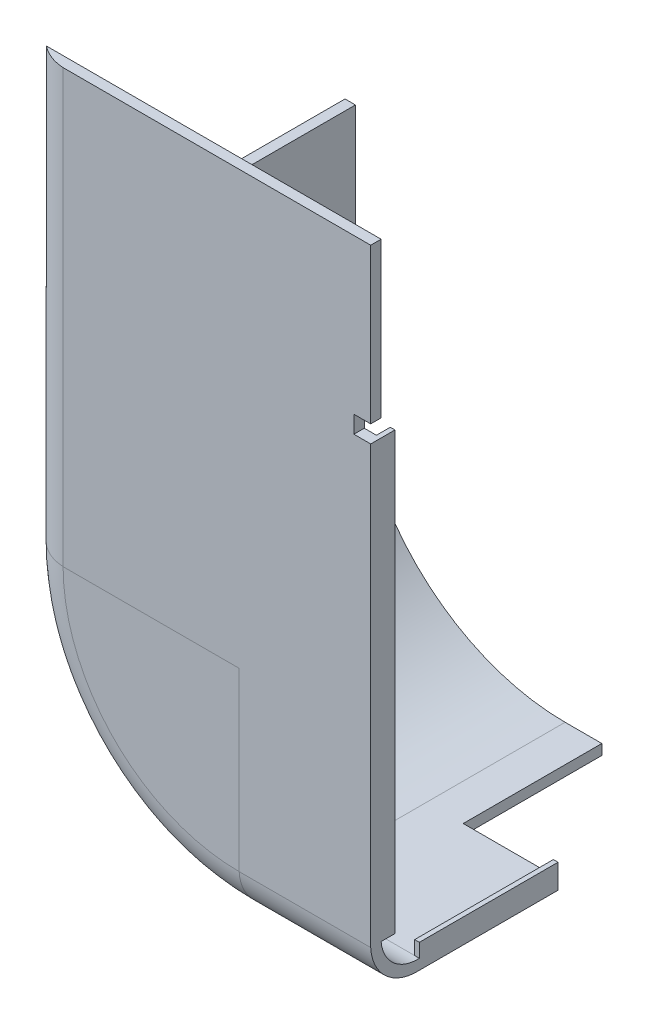
ISO-10303-21;
HEADER;
FILE_DESCRIPTION(('STEP AP214'),'2;1');
FILE_NAME('part.step','',(''),(''),'','','');
FILE_SCHEMA(('AUTOMOTIVE_DESIGN { 1 0 10303 214 1 1 1 1 }'));
ENDSEC;
DATA;
#1=APPLICATION_CONTEXT('core data for automotive mechanical design processes');
#2=APPLICATION_PROTOCOL_DEFINITION('international standard','automotive_design',2000,#1);
#3=PRODUCT_CONTEXT('',#1,'mechanical');
#4=PRODUCT('Part','Part','',(#3));
#5=PRODUCT_RELATED_PRODUCT_CATEGORY('part','',(#4));
#6=PRODUCT_DEFINITION_FORMATION('','',#4);
#7=PRODUCT_DEFINITION_CONTEXT('part definition',#1,'design');
#8=PRODUCT_DEFINITION('design','',#6,#7);
#9=PRODUCT_DEFINITION_SHAPE('','',#8);
#10=(LENGTH_UNIT() NAMED_UNIT(*) SI_UNIT(.MILLI.,.METRE.));
#11=(NAMED_UNIT(*) PLANE_ANGLE_UNIT() SI_UNIT($,.RADIAN.));
#12=(NAMED_UNIT(*) SI_UNIT($,.STERADIAN.) SOLID_ANGLE_UNIT());
#13=UNCERTAINTY_MEASURE_WITH_UNIT(LENGTH_MEASURE(1.E-05),#10,'distance_accuracy_value','');
#14=(GEOMETRIC_REPRESENTATION_CONTEXT(3) GLOBAL_UNCERTAINTY_ASSIGNED_CONTEXT((#13)) GLOBAL_UNIT_ASSIGNED_CONTEXT((#10,
#11,#12)) REPRESENTATION_CONTEXT('',''));
#15=CARTESIAN_POINT('',(0.,0.,0.));
#16=DIRECTION('',(0.,0.,1.));
#17=DIRECTION('',(1.,0.,0.));
#18=AXIS2_PLACEMENT_3D('',#15,#16,#17);
#19=CARTESIAN_POINT('',(-38.1,101.6,91.0390992622291));
#20=DIRECTION('',(0.,0.,1.));
#21=DIRECTION('',(1.,0.,0.));
#22=AXIS2_PLACEMENT_3D('',#19,#20,#21);
#23=PLANE('',#22);
#24=DIRECTION('',(0.,1.,0.));
#25=VECTOR('',#24,1.);
#26=CARTESIAN_POINT('',(-0.150000000000018,101.6,91.0390992622291));
#27=LINE('',#26,#25);
#28=CARTESIAN_POINT('',(-0.15000000000003,41.9405176116687,91.0390992622291));
#29=VERTEX_POINT('',#28);
#30=CARTESIAN_POINT('',(-0.150000000000025,86.6,91.0390992622291));
#31=VERTEX_POINT('',#30);
#32=EDGE_CURVE('E80',#29,#31,#27,.T.);
#33=ORIENTED_EDGE('',*,*,#32,.F.);
#34=DIRECTION('',(-1.,0.,0.));
#35=VECTOR('',#34,1.);
#36=CARTESIAN_POINT('',(-38.1,41.9405176116687,91.0390992622291));
#37=LINE('',#36,#35);
#38=CARTESIAN_POINT('',(-5.,41.9405176116687,91.0390992622291));
#39=VERTEX_POINT('',#38);
#40=EDGE_CURVE('E387',#29,#39,#37,.T.);
#41=ORIENTED_EDGE('',*,*,#40,.T.);
#42=DIRECTION('',(0.,-1.,0.));
#43=VECTOR('',#42,1.);
#44=CARTESIAN_POINT('',(-5.,101.6,91.0390992622291));
#45=LINE('',#44,#43);
#46=CARTESIAN_POINT('',(-5.,36.9405176116687,91.0390992622291));
#47=VERTEX_POINT('',#46);
#48=EDGE_CURVE('E384',#39,#47,#45,.T.);
#49=ORIENTED_EDGE('',*,*,#48,.T.);
#50=DIRECTION('',(1.,0.,0.));
#51=VECTOR('',#50,1.);
#52=CARTESIAN_POINT('',(-38.1,36.9405176116687,91.0390992622291));
#53=LINE('',#52,#51);
#54=CARTESIAN_POINT('',(-1.49999999999997,36.9405176116687,91.0390992622291));
#55=VERTEX_POINT('',#54);
#56=EDGE_CURVE('E381',#47,#55,#53,.T.);
#57=ORIENTED_EDGE('',*,*,#56,.T.);
#58=DIRECTION('',(0.,1.,0.));
#59=VECTOR('',#58,1.);
#60=CARTESIAN_POINT('',(-1.49999999999997,-88.9,91.0390992622291));
#61=LINE('',#60,#59);
#62=CARTESIAN_POINT('',(-1.49999999999997,-88.9000000000001,91.0390992622291));
#63=VERTEX_POINT('',#62);
#64=EDGE_CURVE('E268',#63,#55,#61,.T.);
#65=ORIENTED_EDGE('',*,*,#64,.F.);
#66=DIRECTION('',(1.,0.,0.));
#67=VECTOR('',#66,1.);
#68=CARTESIAN_POINT('',(-38.0999999999999,-88.9,91.0390992622291));
#69=LINE('',#68,#67);
#70=CARTESIAN_POINT('',(-38.0999999999999,-88.8999999999998,91.0390992622291));
#71=VERTEX_POINT('',#70);
#72=EDGE_CURVE('E283',#71,#63,#69,.T.);
#73=ORIENTED_EDGE('',*,*,#72,.F.);
#74=DIRECTION('',(0.,-1.,0.));
#75=VECTOR('',#74,1.);
#76=CARTESIAN_POINT('',(-38.0999999999998,-38.1,91.0390992622291));
#77=LINE('',#76,#75);
#78=CARTESIAN_POINT('',(-38.1,-38.1,91.0390992622291));
#79=VERTEX_POINT('',#78);
#80=EDGE_CURVE('E439',#79,#71,#77,.T.);
#81=ORIENTED_EDGE('',*,*,#80,.F.);
#82=DIRECTION('',(-1.,0.,0.));
#83=VECTOR('',#82,1.);
#84=CARTESIAN_POINT('',(-38.1,-38.1,91.0390992622291));
#85=LINE('',#84,#83);
#86=CARTESIAN_POINT('',(-88.9,-38.1,91.0390992622291));
#87=VERTEX_POINT('',#86);
#88=EDGE_CURVE('E383',#79,#87,#85,.T.);
#89=ORIENTED_EDGE('',*,*,#88,.T.);
#90=DIRECTION('',(0.,-1.,0.));
#91=VECTOR('',#90,1.);
#92=CARTESIAN_POINT('',(-88.9,101.6,91.0390992622291));
#93=LINE('',#92,#91);
#94=CARTESIAN_POINT('',(-88.9,25.4,91.0390992622291));
#95=VERTEX_POINT('',#94);
#96=EDGE_CURVE('E434',#95,#87,#93,.T.);
#97=ORIENTED_EDGE('',*,*,#96,.F.);
#98=DIRECTION('',(1.,0.,0.));
#99=VECTOR('',#98,1.);
#100=CARTESIAN_POINT('',(122.458490874742,25.4,91.0390992622291));
#101=LINE('',#100,#99);
#102=CARTESIAN_POINT('',(-96.6960037763842,25.4,91.0390992622291));
#103=VERTEX_POINT('',#102);
#104=EDGE_CURVE('E427',#103,#95,#101,.T.);
#105=ORIENTED_EDGE('',*,*,#104,.F.);
#106=DIRECTION('',(0.,-1.,0.));
#107=VECTOR('',#106,1.);
#108=CARTESIAN_POINT('',(-96.6960037763842,101.6,91.0390992622291));
#109=LINE('',#108,#107);
#110=CARTESIAN_POINT('',(-96.6960037763842,86.6,91.0390992622291));
#111=VERTEX_POINT('',#110);
#112=EDGE_CURVE('E421',#111,#103,#109,.T.);
#113=ORIENTED_EDGE('',*,*,#112,.F.);
#114=DIRECTION('',(-1.,0.,0.));
#115=VECTOR('',#114,1.);
#116=CARTESIAN_POINT('',(-38.1,86.6,91.0390992622291));
#117=LINE('',#116,#115);
#118=EDGE_CURVE('E292',#31,#111,#117,.T.);
#119=ORIENTED_EDGE('',*,*,#118,.F.);
#120=EDGE_LOOP('',(#33,#41,#49,#57,#65,#73,#81,#89,#97,#105,#113,#119));
#121=FACE_BOUND('',#120,.T.);
#122=ADVANCED_FACE('F70',(#121),#23,.F.);
#123=CARTESIAN_POINT('',(-38.1,101.6,94.0390992622291));
#124=DIRECTION('',(0.,0.,-1.));
#125=DIRECTION('',(-1.,0.,0.));
#126=AXIS2_PLACEMENT_3D('',#123,#124,#125);
#127=PLANE('',#126);
#128=DIRECTION('',(0.,-1.,0.));
#129=VECTOR('',#128,1.);
#130=CARTESIAN_POINT('',(-0.150000000000018,101.6,94.0390992622291));
#131=LINE('',#130,#129);
#132=CARTESIAN_POINT('',(-0.150000000000022,86.6,94.0390992622291));
#133=VERTEX_POINT('',#132);
#134=CARTESIAN_POINT('',(-0.15000000000003,41.9405176116687,94.0390992622291));
#135=VERTEX_POINT('',#134);
#136=EDGE_CURVE('E12',#133,#135,#131,.T.);
#137=ORIENTED_EDGE('',*,*,#136,.F.);
#138=DIRECTION('',(1.,0.,0.));
#139=VECTOR('',#138,1.);
#140=CARTESIAN_POINT('',(-38.1,86.6,94.0390992622291));
#141=LINE('',#140,#139);
#142=CARTESIAN_POINT('',(-88.9,86.6,94.0390992622291));
#143=VERTEX_POINT('',#142);
#144=EDGE_CURVE('E293',#143,#133,#141,.T.);
#145=ORIENTED_EDGE('',*,*,#144,.F.);
#146=DIRECTION('',(0.,-1.,0.));
#147=VECTOR('',#146,1.);
#148=CARTESIAN_POINT('',(-88.9,101.6,94.0390992622291));
#149=LINE('',#148,#147);
#150=CARTESIAN_POINT('',(-88.9,-38.1,94.0390992622291));
#151=VERTEX_POINT('',#150);
#152=EDGE_CURVE('E446',#143,#151,#149,.T.);
#153=ORIENTED_EDGE('',*,*,#152,.T.);
#154=DIRECTION('',(1.,0.,0.));
#155=VECTOR('',#154,1.);
#156=CARTESIAN_POINT('',(-38.1,-38.1,94.0390992622291));
#157=LINE('',#156,#155);
#158=CARTESIAN_POINT('',(-38.1,-38.1,94.0390992622291));
#159=VERTEX_POINT('',#158);
#160=EDGE_CURVE('E449',#151,#159,#157,.T.);
#161=ORIENTED_EDGE('',*,*,#160,.T.);
#162=DIRECTION('',(0.,1.,0.));
#163=VECTOR('',#162,1.);
#164=CARTESIAN_POINT('',(-38.0999999999998,-38.1,94.0390992622291));
#165=LINE('',#164,#163);
#166=CARTESIAN_POINT('',(-38.0999999999999,-88.8999999999998,94.0390992622291));
#167=VERTEX_POINT('',#166);
#168=EDGE_CURVE('E442',#167,#159,#165,.T.);
#169=ORIENTED_EDGE('',*,*,#168,.F.);
#170=DIRECTION('',(1.,0.,0.));
#171=VECTOR('',#170,1.);
#172=CARTESIAN_POINT('',(-38.0999999999999,-88.9,94.0390992622291));
#173=LINE('',#172,#171);
#174=CARTESIAN_POINT('',(-0.150000000000055,-88.9000000000001,94.0390992622291));
#175=VERTEX_POINT('',#174);
#176=EDGE_CURVE('E317',#167,#175,#173,.T.);
#177=ORIENTED_EDGE('',*,*,#176,.T.);
#178=CARTESIAN_POINT('',(-0.150000000000032,36.9405176116687,94.0390992622291));
#179=VERTEX_POINT('',#178);
#180=EDGE_CURVE('E82',#179,#175,#131,.T.);
#181=ORIENTED_EDGE('',*,*,#180,.F.);
#182=DIRECTION('',(1.,0.,0.));
#183=VECTOR('',#182,1.);
#184=CARTESIAN_POINT('',(-5.,36.9405176116687,94.0390992622291));
#185=LINE('',#184,#183);
#186=CARTESIAN_POINT('',(-5.,36.9405176116687,94.0390992622291));
#187=VERTEX_POINT('',#186);
#188=EDGE_CURVE('E315',#187,#179,#185,.T.);
#189=ORIENTED_EDGE('',*,*,#188,.F.);
#190=DIRECTION('',(0.,-1.,0.));
#191=VECTOR('',#190,1.);
#192=CARTESIAN_POINT('',(-5.,41.9405176116687,94.0390992622291));
#193=LINE('',#192,#191);
#194=CARTESIAN_POINT('',(-5.,41.9405176116687,94.0390992622291));
#195=VERTEX_POINT('',#194);
#196=EDGE_CURVE('E328',#195,#187,#193,.T.);
#197=ORIENTED_EDGE('',*,*,#196,.F.);
#198=DIRECTION('',(-1.,0.,0.));
#199=VECTOR('',#198,1.);
#200=CARTESIAN_POINT('',(-5.,41.9405176116687,94.0390992622291));
#201=LINE('',#200,#199);
#202=EDGE_CURVE('E321',#135,#195,#201,.T.);
#203=ORIENTED_EDGE('',*,*,#202,.F.);
#204=EDGE_LOOP('',(#137,#145,#153,#161,#169,#177,#181,#189,#197,#203));
#205=FACE_BOUND('',#204,.T.);
#206=ADVANCED_FACE('F313',(#205),#127,.F.);
#207=CARTESIAN_POINT('',(-38.0999999999999,-101.6,60.));
#208=DIRECTION('',(0.,1.,0.));
#209=DIRECTION('',(-1.,0.,0.));
#210=AXIS2_PLACEMENT_3D('',#207,#208,#209);
#211=PLANE('',#210);
#212=DIRECTION('',(0.,0.,-1.));
#213=VECTOR('',#212,1.);
#214=CARTESIAN_POINT('',(-0.15000000000006,-101.6,60.));
#215=LINE('',#214,#213);
#216=CARTESIAN_POINT('',(-0.150000000000055,-101.6,80.));
#217=VERTEX_POINT('',#216);
#218=CARTESIAN_POINT('',(-0.15000000000006,-101.6,40.));
#219=VERTEX_POINT('',#218);
#220=EDGE_CURVE('E287',#217,#219,#215,.T.);
#221=ORIENTED_EDGE('',*,*,#220,.F.);
#222=DIRECTION('',(1.,0.,0.));
#223=VECTOR('',#222,1.);
#224=CARTESIAN_POINT('',(-38.0999999999999,-101.6,80.));
#225=LINE('',#224,#223);
#226=CARTESIAN_POINT('',(-38.0999999999999,-101.6,80.));
#227=VERTEX_POINT('',#226);
#228=EDGE_CURVE('E403',#227,#217,#225,.T.);
#229=ORIENTED_EDGE('',*,*,#228,.F.);
#230=DIRECTION('',(0.,0.,-1.));
#231=VECTOR('',#230,1.);
#232=CARTESIAN_POINT('',(-38.0999999999999,-101.6,60.));
#233=LINE('',#232,#231);
#234=CARTESIAN_POINT('',(-38.0999999999999,-101.6,0.));
#235=VERTEX_POINT('',#234);
#236=EDGE_CURVE('E389',#227,#235,#233,.T.);
#237=ORIENTED_EDGE('',*,*,#236,.T.);
#238=DIRECTION('',(1.,0.,0.));
#239=VECTOR('',#238,1.);
#240=CARTESIAN_POINT('',(-38.0999999999999,-101.6,0.));
#241=LINE('',#240,#239);
#242=CARTESIAN_POINT('',(-27.5000000000001,-101.6,0.));
#243=VERTEX_POINT('',#242);
#244=EDGE_CURVE('E392',#235,#243,#241,.T.);
#245=ORIENTED_EDGE('',*,*,#244,.T.);
#246=DIRECTION('',(0.,0.,-1.));
#247=VECTOR('',#246,1.);
#248=CARTESIAN_POINT('',(-27.5000000000001,-101.6,0.));
#249=LINE('',#248,#247);
#250=CARTESIAN_POINT('',(-27.5000000000001,-101.6,40.));
#251=VERTEX_POINT('',#250);
#252=EDGE_CURVE('E335',#251,#243,#249,.T.);
#253=ORIENTED_EDGE('',*,*,#252,.F.);
#254=DIRECTION('',(-1.,0.,0.));
#255=VECTOR('',#254,1.);
#256=CARTESIAN_POINT('',(-27.5000000000001,-101.6,40.));
#257=LINE('',#256,#255);
#258=EDGE_CURVE('E323',#219,#251,#257,.T.);
#259=ORIENTED_EDGE('',*,*,#258,.F.);
#260=EDGE_LOOP('',(#221,#229,#237,#245,#253,#259));
#261=FACE_BOUND('',#260,.T.);
#262=ADVANCED_FACE('F529',(#261),#211,.F.);
#263=CARTESIAN_POINT('',(-38.0999999999999,-88.2304503688855,80.6695496311146));
#264=DIRECTION('',(1.,0.,0.));
#265=DIRECTION('',(0.,1.,0.));
#266=AXIS2_PLACEMENT_3D('',#263,#264,#265);
#267=CYLINDRICAL_SURFACE('',#266,13.3863047196514);
#268=CARTESIAN_POINT('',(-0.150000000000053,-88.2304503688855,80.6695496311146));
#269=DIRECTION('',(1.,0.,0.));
#270=DIRECTION('',(0.,1.,0.));
#271=AXIS2_PLACEMENT_3D('',#268,#269,#270);
#272=CIRCLE('',#271,13.3863047196514);
#273=EDGE_CURVE('E300',#175,#217,#272,.T.);
#274=ORIENTED_EDGE('',*,*,#273,.F.);
#275=ORIENTED_EDGE('',*,*,#176,.F.);
#276=CARTESIAN_POINT('',(-38.0999999999999,-88.2304503688855,80.6695496311146));
#277=DIRECTION('',(-1.,0.,0.));
#278=DIRECTION('',(0.,-1.,0.));
#279=AXIS2_PLACEMENT_3D('',#276,#277,#278);
#280=CIRCLE('',#279,13.3863047196514);
#281=EDGE_CURVE('E455',#227,#167,#280,.T.);
#282=ORIENTED_EDGE('',*,*,#281,.F.);
#283=ORIENTED_EDGE('',*,*,#228,.T.);
#284=EDGE_LOOP('',(#274,#275,#282,#283));
#285=FACE_BOUND('',#284,.T.);
#286=ADVANCED_FACE('F541',(#285),#267,.T.);
#287=CARTESIAN_POINT('',(-38.0999999999999,-88.0411646290642,80.5032252207029));
#288=DIRECTION('',(1.,0.,0.));
#289=DIRECTION('',(0.,1.,0.));
#290=AXIS2_PLACEMENT_3D('',#287,#288,#289);
#291=CYLINDRICAL_SURFACE('',#290,10.5708202147836);
#292=CARTESIAN_POINT('',(-0.150000000000053,-88.0411646290642,80.5032252207029));
#293=DIRECTION('',(1.,0.,0.));
#294=DIRECTION('',(0.,1.,0.));
#295=AXIS2_PLACEMENT_3D('',#292,#293,#294);
#296=CIRCLE('',#295,10.5708202147836);
#297=CARTESIAN_POINT('',(-0.150000000000055,-98.6000000000001,80.));
#298=VERTEX_POINT('',#297);
#299=CARTESIAN_POINT('',(-0.150000000000056,-88.8999999999999,91.0390992622291));
#300=VERTEX_POINT('',#299);
#301=EDGE_CURVE('E123',#298,#300,#296,.F.);
#302=ORIENTED_EDGE('',*,*,#301,.F.);
#303=DIRECTION('',(1.,0.,0.));
#304=VECTOR('',#303,1.);
#305=CARTESIAN_POINT('',(-1.31838984174237E-13,-98.6,80.));
#306=LINE('',#305,#304);
#307=CARTESIAN_POINT('',(-1.5,-98.6,80.));
#308=VERTEX_POINT('',#307);
#309=EDGE_CURVE('E354',#308,#298,#306,.T.);
#310=ORIENTED_EDGE('',*,*,#309,.F.);
#311=DIRECTION('',(1.,0.,0.));
#312=VECTOR('',#311,1.);
#313=CARTESIAN_POINT('',(-38.0999999999999,-98.6,80.));
#314=LINE('',#313,#312);
#315=CARTESIAN_POINT('',(-38.0999999999999,-98.5999999999998,80.));
#316=VERTEX_POINT('',#315);
#317=EDGE_CURVE('E261',#316,#308,#314,.T.);
#318=ORIENTED_EDGE('',*,*,#317,.F.);
#319=CARTESIAN_POINT('',(-38.0999999999999,-88.0411646290642,80.5032252207029));
#320=DIRECTION('',(1.,0.,0.));
#321=DIRECTION('',(0.,-1.,0.));
#322=AXIS2_PLACEMENT_3D('',#319,#320,#321);
#323=CIRCLE('',#322,10.5708202147836);
#324=EDGE_CURVE('E424',#71,#316,#323,.T.);
#325=ORIENTED_EDGE('',*,*,#324,.F.);
#326=ORIENTED_EDGE('',*,*,#72,.T.);
#327=DIRECTION('',(-1.,0.,0.));
#328=VECTOR('',#327,1.);
#329=CARTESIAN_POINT('',(1.5,-88.9000000000001,91.0390992622291));
#330=LINE('',#329,#328);
#331=EDGE_CURVE('E265',#300,#63,#330,.T.);
#332=ORIENTED_EDGE('',*,*,#331,.F.);
#333=EDGE_LOOP('',(#302,#310,#318,#325,#326,#332));
#334=FACE_BOUND('',#333,.T.);
#335=ADVANCED_FACE('F538',(#334),#291,.F.);
#336=CARTESIAN_POINT('',(-5.,36.9405176116687,0.));
#337=DIRECTION('',(0.,-1.,0.));
#338=DIRECTION('',(0.,0.,-1.));
#339=AXIS2_PLACEMENT_3D('',#336,#337,#338);
#340=PLANE('',#339);
#341=DIRECTION('',(0.,0.,1.));
#342=VECTOR('',#341,1.);
#343=CARTESIAN_POINT('',(-0.150000000000032,36.9405176116687,0.));
#344=LINE('',#343,#342);
#345=CARTESIAN_POINT('',(-0.150000000000032,36.9405176116687,87.0390992622291));
#346=VERTEX_POINT('',#345);
#347=EDGE_CURVE('E303',#346,#179,#344,.T.);
#348=ORIENTED_EDGE('',*,*,#347,.F.);
#349=DIRECTION('',(-1.,0.,0.));
#350=VECTOR('',#349,1.);
#351=CARTESIAN_POINT('',(1.50000000000002,36.9405176116687,87.0390992622291));
#352=LINE('',#351,#350);
#353=CARTESIAN_POINT('',(-1.49999999999998,36.9405176116687,87.0390992622291));
#354=VERTEX_POINT('',#353);
#355=EDGE_CURVE('E280',#346,#354,#352,.T.);
#356=ORIENTED_EDGE('',*,*,#355,.T.);
#357=DIRECTION('',(0.,0.,1.));
#358=VECTOR('',#357,1.);
#359=CARTESIAN_POINT('',(-1.49999999999998,36.9405176116687,87.0390992622291));
#360=LINE('',#359,#358);
#361=EDGE_CURVE('E260',#354,#55,#360,.T.);
#362=ORIENTED_EDGE('',*,*,#361,.T.);
#363=ORIENTED_EDGE('',*,*,#56,.F.);
#364=DIRECTION('',(0.,0.,1.));
#365=VECTOR('',#364,1.);
#366=CARTESIAN_POINT('',(-5.,36.9405176116687,0.));
#367=LINE('',#366,#365);
#368=EDGE_CURVE('E279',#47,#187,#367,.T.);
#369=ORIENTED_EDGE('',*,*,#368,.T.);
#370=ORIENTED_EDGE('',*,*,#188,.T.);
#371=EDGE_LOOP('',(#348,#356,#362,#363,#369,#370));
#372=FACE_BOUND('',#371,.T.);
#373=ADVANCED_FACE('F318',(#372),#340,.F.);
#374=CARTESIAN_POINT('',(-5.,41.9405176116687,0.));
#375=DIRECTION('',(0.,1.,0.));
#376=DIRECTION('',(0.,0.,1.));
#377=AXIS2_PLACEMENT_3D('',#374,#375,#376);
#378=PLANE('',#377);
#379=DIRECTION('',(0.,0.,-1.));
#380=VECTOR('',#379,1.);
#381=CARTESIAN_POINT('',(-0.150000000000031,41.9405176116687,0.));
#382=LINE('',#381,#380);
#383=EDGE_CURVE('E285',#135,#29,#382,.T.);
#384=ORIENTED_EDGE('',*,*,#383,.F.);
#385=ORIENTED_EDGE('',*,*,#202,.T.);
#386=DIRECTION('',(0.,0.,1.));
#387=VECTOR('',#386,1.);
#388=CARTESIAN_POINT('',(-5.,41.9405176116687,0.));
#389=LINE('',#388,#387);
#390=EDGE_CURVE('E330',#39,#195,#389,.T.);
#391=ORIENTED_EDGE('',*,*,#390,.F.);
#392=ORIENTED_EDGE('',*,*,#40,.F.);
#393=EDGE_LOOP('',(#384,#385,#391,#392));
#394=FACE_BOUND('',#393,.T.);
#395=ADVANCED_FACE('F489',(#394),#378,.F.);
#396=CARTESIAN_POINT('',(-27.4999999999999,101.6,40.));
#397=DIRECTION('',(0.,0.,1.));
#398=DIRECTION('',(1.,0.,0.));
#399=AXIS2_PLACEMENT_3D('',#396,#397,#398);
#400=PLANE('',#399);
#401=DIRECTION('',(0.,1.,0.));
#402=VECTOR('',#401,1.);
#403=CARTESIAN_POINT('',(-0.150000000000018,101.6,40.));
#404=LINE('',#403,#402);
#405=CARTESIAN_POINT('',(-0.150000000000057,-94.6,40.));
#406=VERTEX_POINT('',#405);
#407=EDGE_CURVE('E267',#219,#406,#404,.T.);
#408=ORIENTED_EDGE('',*,*,#407,.F.);
#409=ORIENTED_EDGE('',*,*,#258,.T.);
#410=DIRECTION('',(0.,-1.,0.));
#411=VECTOR('',#410,1.);
#412=CARTESIAN_POINT('',(-27.4999999999999,101.6,40.));
#413=LINE('',#412,#411);
#414=CARTESIAN_POINT('',(-27.5000000000001,-98.6,40.));
#415=VERTEX_POINT('',#414);
#416=EDGE_CURVE('E332',#415,#251,#413,.T.);
#417=ORIENTED_EDGE('',*,*,#416,.F.);
#418=DIRECTION('',(1.,0.,0.));
#419=VECTOR('',#418,1.);
#420=CARTESIAN_POINT('',(-38.0999999999999,-98.6,40.));
#421=LINE('',#420,#419);
#422=CARTESIAN_POINT('',(-1.5,-98.6,40.));
#423=VERTEX_POINT('',#422);
#424=EDGE_CURVE('E344',#415,#423,#421,.T.);
#425=ORIENTED_EDGE('',*,*,#424,.T.);
#426=DIRECTION('',(0.,-1.,0.));
#427=VECTOR('',#426,1.);
#428=CARTESIAN_POINT('',(-1.5,-94.6,40.));
#429=LINE('',#428,#427);
#430=CARTESIAN_POINT('',(-1.5,-94.6,40.));
#431=VERTEX_POINT('',#430);
#432=EDGE_CURVE('E272',#431,#423,#429,.T.);
#433=ORIENTED_EDGE('',*,*,#432,.F.);
#434=DIRECTION('',(-1.,0.,0.));
#435=VECTOR('',#434,1.);
#436=CARTESIAN_POINT('',(-1.5,-94.6,40.));
#437=LINE('',#436,#435);
#438=EDGE_CURVE('E276',#406,#431,#437,.T.);
#439=ORIENTED_EDGE('',*,*,#438,.F.);
#440=EDGE_LOOP('',(#408,#409,#417,#425,#433,#439));
#441=FACE_BOUND('',#440,.T.);
#442=ADVANCED_FACE('F372',(#441),#400,.F.);
#443=CARTESIAN_POINT('',(0.,86.6,0.));
#444=DIRECTION('',(0.,1.,0.));
#445=DIRECTION('',(-1.,0.,0.));
#446=AXIS2_PLACEMENT_3D('',#443,#444,#445);
#447=PLANE('',#446);
#448=ORIENTED_EDGE('',*,*,#144,.T.);
#449=DIRECTION('',(0.,0.,-1.));
#450=VECTOR('',#449,1.);
#451=CARTESIAN_POINT('',(-0.150000000000022,86.6,0.));
#452=LINE('',#451,#450);
#453=EDGE_CURVE('E290',#133,#31,#452,.T.);
#454=ORIENTED_EDGE('',*,*,#453,.T.);
#455=ORIENTED_EDGE('',*,*,#118,.T.);
#456=CARTESIAN_POINT('',(-88.2304503688855,86.6,80.6695496311146));
#457=DIRECTION('',(0.,1.,0.));
#458=DIRECTION('',(-1.,0.,0.));
#459=AXIS2_PLACEMENT_3D('',#456,#457,#458);
#460=CIRCLE('',#459,13.3863047196514);
#461=EDGE_CURVE('E345',#111,#143,#460,.T.);
#462=ORIENTED_EDGE('',*,*,#461,.T.);
#463=EDGE_LOOP('',(#448,#454,#455,#462));
#464=FACE_BOUND('',#463,.T.);
#465=ADVANCED_FACE('F498',(#464),#447,.T.);
#466=CARTESIAN_POINT('',(-1.31838984174237E-13,-94.6,80.));
#467=DIRECTION('',(0.,0.,-1.));
#468=DIRECTION('',(-1.,0.,0.));
#469=AXIS2_PLACEMENT_3D('',#466,#467,#468);
#470=PLANE('',#469);
#471=DIRECTION('',(0.,-1.,0.));
#472=VECTOR('',#471,1.);
#473=CARTESIAN_POINT('',(-0.150000000000057,-94.6,80.));
#474=LINE('',#473,#472);
#475=CARTESIAN_POINT('',(-0.150000000000057,-94.6,80.));
#476=VERTEX_POINT('',#475);
#477=EDGE_CURVE('E270',#476,#298,#474,.T.);
#478=ORIENTED_EDGE('',*,*,#477,.F.);
#479=DIRECTION('',(1.,0.,0.));
#480=VECTOR('',#479,1.);
#481=CARTESIAN_POINT('',(-1.31838984174237E-13,-94.6,80.));
#482=LINE('',#481,#480);
#483=CARTESIAN_POINT('',(-1.5,-94.6,80.));
#484=VERTEX_POINT('',#483);
#485=EDGE_CURVE('E298',#484,#476,#482,.T.);
#486=ORIENTED_EDGE('',*,*,#485,.F.);
#487=DIRECTION('',(0.,-1.,0.));
#488=VECTOR('',#487,1.);
#489=CARTESIAN_POINT('',(-1.5,-94.6,80.));
#490=LINE('',#489,#488);
#491=EDGE_CURVE('E347',#484,#308,#490,.T.);
#492=ORIENTED_EDGE('',*,*,#491,.T.);
#493=ORIENTED_EDGE('',*,*,#309,.T.);
#494=EDGE_LOOP('',(#478,#486,#492,#493));
#495=FACE_BOUND('',#494,.T.);
#496=ADVANCED_FACE('F595',(#495),#470,.F.);
#497=CARTESIAN_POINT('',(0.,-94.6,0.));
#498=DIRECTION('',(0.,1.,0.));
#499=DIRECTION('',(0.,0.,1.));
#500=AXIS2_PLACEMENT_3D('',#497,#498,#499);
#501=PLANE('',#500);
#502=ORIENTED_EDGE('',*,*,#485,.T.);
#503=DIRECTION('',(0.,0.,-1.));
#504=VECTOR('',#503,1.);
#505=CARTESIAN_POINT('',(-0.150000000000057,-94.6,0.));
#506=LINE('',#505,#504);
#507=EDGE_CURVE('E295',#476,#406,#506,.T.);
#508=ORIENTED_EDGE('',*,*,#507,.T.);
#509=ORIENTED_EDGE('',*,*,#438,.T.);
#510=DIRECTION('',(0.,0.,1.));
#511=VECTOR('',#510,1.);
#512=CARTESIAN_POINT('',(-1.5,-94.6,80.));
#513=LINE('',#512,#511);
#514=EDGE_CURVE('E281',#431,#484,#513,.T.);
#515=ORIENTED_EDGE('',*,*,#514,.T.);
#516=EDGE_LOOP('',(#502,#508,#509,#515));
#517=FACE_BOUND('',#516,.T.);
#518=ADVANCED_FACE('F363',(#517),#501,.T.);
#519=CARTESIAN_POINT('',(1.5,-88.9000000000001,87.0390992622291));
#520=DIRECTION('',(0.,1.,0.));
#521=DIRECTION('',(-1.,0.,0.));
#522=AXIS2_PLACEMENT_3D('',#519,#520,#521);
#523=PLANE('',#522);
#524=DIRECTION('',(0.,0.,-1.));
#525=VECTOR('',#524,1.);
#526=CARTESIAN_POINT('',(-0.150000000000056,-88.8999999999999,87.0390992622291));
#527=LINE('',#526,#525);
#528=CARTESIAN_POINT('',(-0.150000000000044,-88.9,87.0390992622291));
#529=VERTEX_POINT('',#528);
#530=EDGE_CURVE('E74',#300,#529,#527,.T.);
#531=ORIENTED_EDGE('',*,*,#530,.F.);
#532=ORIENTED_EDGE('',*,*,#331,.T.);
#533=DIRECTION('',(0.,0.,1.));
#534=VECTOR('',#533,1.);
#535=CARTESIAN_POINT('',(-1.49999999999998,-88.9,87.0390992622291));
#536=LINE('',#535,#534);
#537=CARTESIAN_POINT('',(-1.49999999999998,-88.9,87.0390992622291));
#538=VERTEX_POINT('',#537);
#539=EDGE_CURVE('E258',#538,#63,#536,.T.);
#540=ORIENTED_EDGE('',*,*,#539,.F.);
#541=DIRECTION('',(-1.,0.,0.));
#542=VECTOR('',#541,1.);
#543=CARTESIAN_POINT('',(-1.21939013113065E-13,-88.8999999999999,87.0390992622291));
#544=LINE('',#543,#542);
#545=EDGE_CURVE('E244',#529,#538,#544,.T.);
#546=ORIENTED_EDGE('',*,*,#545,.F.);
#547=EDGE_LOOP('',(#531,#532,#540,#546));
#548=FACE_BOUND('',#547,.T.);
#549=ADVANCED_FACE('F263',(#548),#523,.F.);
#550=CARTESIAN_POINT('',(0.,0.,87.0390992622291));
#551=DIRECTION('',(0.,0.,-1.));
#552=DIRECTION('',(-1.,0.,0.));
#553=AXIS2_PLACEMENT_3D('',#550,#551,#552);
#554=PLANE('',#553);
#555=ORIENTED_EDGE('',*,*,#355,.F.);
#556=DIRECTION('',(0.,-1.,0.));
#557=VECTOR('',#556,1.);
#558=CARTESIAN_POINT('',(-0.150000000000039,0.,87.0390992622291));
#559=LINE('',#558,#557);
#560=EDGE_CURVE('E250',#346,#529,#559,.T.);
#561=ORIENTED_EDGE('',*,*,#560,.T.);
#562=ORIENTED_EDGE('',*,*,#545,.T.);
#563=DIRECTION('',(0.,1.,0.));
#564=VECTOR('',#563,1.);
#565=CARTESIAN_POINT('',(-1.49999999999998,-88.9,87.0390992622291));
#566=LINE('',#565,#564);
#567=EDGE_CURVE('E248',#538,#354,#566,.T.);
#568=ORIENTED_EDGE('',*,*,#567,.T.);
#569=EDGE_LOOP('',(#555,#561,#562,#568));
#570=FACE_BOUND('',#569,.T.);
#571=ADVANCED_FACE('F247',(#570),#554,.T.);
#572=CARTESIAN_POINT('',(-38.0999999999999,-98.6,60.));
#573=DIRECTION('',(0.,1.,0.));
#574=DIRECTION('',(0.,0.,1.));
#575=AXIS2_PLACEMENT_3D('',#572,#573,#574);
#576=PLANE('',#575);
#577=ORIENTED_EDGE('',*,*,#317,.T.);
#578=DIRECTION('',(0.,0.,1.));
#579=VECTOR('',#578,1.);
#580=CARTESIAN_POINT('',(-1.5,-98.6,80.));
#581=LINE('',#580,#579);
#582=EDGE_CURVE('E342',#423,#308,#581,.T.);
#583=ORIENTED_EDGE('',*,*,#582,.F.);
#584=ORIENTED_EDGE('',*,*,#424,.F.);
#585=DIRECTION('',(0.,0.,1.));
#586=VECTOR('',#585,1.);
#587=CARTESIAN_POINT('',(-27.5000000000001,-98.6,60.));
#588=LINE('',#587,#586);
#589=CARTESIAN_POINT('',(-27.5000000000001,-98.6,0.));
#590=VERTEX_POINT('',#589);
#591=EDGE_CURVE('E329',#590,#415,#588,.T.);
#592=ORIENTED_EDGE('',*,*,#591,.F.);
#593=DIRECTION('',(1.,0.,0.));
#594=VECTOR('',#593,1.);
#595=CARTESIAN_POINT('',(-38.0999999999999,-98.6,0.));
#596=LINE('',#595,#594);
#597=CARTESIAN_POINT('',(-38.0999999999998,-98.6,0.));
#598=VERTEX_POINT('',#597);
#599=EDGE_CURVE('E340',#598,#590,#596,.T.);
#600=ORIENTED_EDGE('',*,*,#599,.F.);
#601=DIRECTION('',(0.,0.,-1.));
#602=VECTOR('',#601,1.);
#603=CARTESIAN_POINT('',(-38.0999999999998,-98.6,60.));
#604=LINE('',#603,#602);
#605=EDGE_CURVE('E404',#316,#598,#604,.T.);
#606=ORIENTED_EDGE('',*,*,#605,.F.);
#607=EDGE_LOOP('',(#577,#583,#584,#592,#600,#606));
#608=FACE_BOUND('',#607,.T.);
#609=ADVANCED_FACE('F551',(#608),#576,.T.);
#610=CARTESIAN_POINT('',(-88.2304503688855,101.6,80.6695496311146));
#611=DIRECTION('',(0.,-1.,0.));
#612=DIRECTION('',(1.,0.,0.));
#613=AXIS2_PLACEMENT_3D('',#610,#611,#612);
#614=CYLINDRICAL_SURFACE('',#613,13.3863047196514);
#615=ORIENTED_EDGE('',*,*,#461,.F.);
#616=ORIENTED_EDGE('',*,*,#112,.T.);
#617=CARTESIAN_POINT('',(-88.2304503688855,25.4,80.6695496311146));
#618=DIRECTION('',(0.,-1.,0.));
#619=DIRECTION('',(1.,0.,0.));
#620=AXIS2_PLACEMENT_3D('',#617,#618,#619);
#621=CIRCLE('',#620,13.3863047196514);
#622=CARTESIAN_POINT('',(-101.6,25.4,80.));
#623=VERTEX_POINT('',#622);
#624=EDGE_CURVE('E468',#103,#623,#621,.T.);
#625=ORIENTED_EDGE('',*,*,#624,.T.);
#626=DIRECTION('',(0.,-1.,0.));
#627=VECTOR('',#626,1.);
#628=CARTESIAN_POINT('',(-101.6,101.6,80.));
#629=LINE('',#628,#627);
#630=CARTESIAN_POINT('',(-101.6,-38.1,80.));
#631=VERTEX_POINT('',#630);
#632=EDGE_CURVE('E462',#623,#631,#629,.T.);
#633=ORIENTED_EDGE('',*,*,#632,.T.);
#634=CARTESIAN_POINT('',(-88.2304503688855,-38.1,80.6695496311146));
#635=DIRECTION('',(0.,1.,0.));
#636=DIRECTION('',(-1.,0.,0.));
#637=AXIS2_PLACEMENT_3D('',#634,#635,#636);
#638=CIRCLE('',#637,13.3863047196514);
#639=EDGE_CURVE('E459',#631,#151,#638,.T.);
#640=ORIENTED_EDGE('',*,*,#639,.T.);
#641=ORIENTED_EDGE('',*,*,#152,.F.);
#642=EDGE_LOOP('',(#615,#616,#625,#633,#640,#641));
#643=FACE_BOUND('',#642,.T.);
#644=ADVANCED_FACE('F501',(#643),#614,.T.);
#645=CARTESIAN_POINT('',(-101.6,101.6,60.));
#646=DIRECTION('',(1.,0.,0.));
#647=DIRECTION('',(0.,1.,0.));
#648=AXIS2_PLACEMENT_3D('',#645,#646,#647);
#649=PLANE('',#648);
#650=ORIENTED_EDGE('',*,*,#632,.F.);
#651=DIRECTION('',(0.,0.,-1.));
#652=VECTOR('',#651,1.);
#653=CARTESIAN_POINT('',(-101.6,25.4,60.));
#654=LINE('',#653,#652);
#655=CARTESIAN_POINT('',(-101.6,25.4,0.));
#656=VERTEX_POINT('',#655);
#657=EDGE_CURVE('E399',#623,#656,#654,.T.);
#658=ORIENTED_EDGE('',*,*,#657,.T.);
#659=DIRECTION('',(0.,-1.,0.));
#660=VECTOR('',#659,1.);
#661=CARTESIAN_POINT('',(-101.6,101.6,0.));
#662=LINE('',#661,#660);
#663=CARTESIAN_POINT('',(-101.6,-38.1,0.));
#664=VERTEX_POINT('',#663);
#665=EDGE_CURVE('E397',#656,#664,#662,.T.);
#666=ORIENTED_EDGE('',*,*,#665,.T.);
#667=DIRECTION('',(0.,0.,-1.));
#668=VECTOR('',#667,1.);
#669=CARTESIAN_POINT('',(-101.6,-38.1,60.));
#670=LINE('',#669,#668);
#671=EDGE_CURVE('E393',#631,#664,#670,.T.);
#672=ORIENTED_EDGE('',*,*,#671,.F.);
#673=EDGE_LOOP('',(#650,#658,#666,#672));
#674=FACE_BOUND('',#673,.T.);
#675=ADVANCED_FACE('F558',(#674),#649,.F.);
#676=CARTESIAN_POINT('',(-38.0999999999999,-38.0999999999999,60.));
#677=DIRECTION('',(0.,0.,-1.));
#678=DIRECTION('',(-1.,0.,0.));
#679=AXIS2_PLACEMENT_3D('',#676,#677,#678);
#680=CYLINDRICAL_SURFACE('',#679,63.5000000000002);
#681=CARTESIAN_POINT('',(-38.0999999999999,-38.0999999999999,0.));
#682=DIRECTION('',(0.,0.,1.));
#683=DIRECTION('',(1.,0.,0.));
#684=AXIS2_PLACEMENT_3D('',#681,#682,#683);
#685=CIRCLE('',#684,63.5000000000002);
#686=EDGE_CURVE('E396',#664,#235,#685,.T.);
#687=ORIENTED_EDGE('',*,*,#686,.T.);
#688=ORIENTED_EDGE('',*,*,#236,.F.);
#689=CARTESIAN_POINT('',(-38.0999999999998,-38.0999999999998,80.));
#690=DIRECTION('',(0.,0.,1.));
#691=DIRECTION('',(-1.,0.,0.));
#692=AXIS2_PLACEMENT_3D('',#689,#690,#691);
#693=CIRCLE('',#692,63.5);
#694=EDGE_CURVE('E433',#631,#227,#693,.T.);
#695=ORIENTED_EDGE('',*,*,#694,.F.);
#696=ORIENTED_EDGE('',*,*,#671,.T.);
#697=EDGE_LOOP('',(#687,#688,#695,#696));
#698=FACE_BOUND('',#697,.T.);
#699=ADVANCED_FACE('F556',(#698),#680,.T.);
#700=CARTESIAN_POINT('',(38.0999999999995,-38.0999999999996,0.));
#701=DIRECTION('',(0.,0.,1.));
#702=DIRECTION('',(1.,0.,0.));
#703=AXIS2_PLACEMENT_3D('',#700,#701,#702);
#704=PLANE('',#703);
#705=ORIENTED_EDGE('',*,*,#599,.T.);
#706=DIRECTION('',(0.,-1.,0.));
#707=VECTOR('',#706,1.);
#708=CARTESIAN_POINT('',(-27.4999999999999,101.6,0.));
#709=LINE('',#708,#707);
#710=EDGE_CURVE('E336',#590,#243,#709,.T.);
#711=ORIENTED_EDGE('',*,*,#710,.T.);
#712=ORIENTED_EDGE('',*,*,#244,.F.);
#713=ORIENTED_EDGE('',*,*,#686,.F.);
#714=ORIENTED_EDGE('',*,*,#665,.F.);
#715=DIRECTION('',(1.,0.,0.));
#716=VECTOR('',#715,1.);
#717=CARTESIAN_POINT('',(38.0999999999995,25.4,0.));
#718=LINE('',#717,#716);
#719=CARTESIAN_POINT('',(-98.6,25.4,0.));
#720=VERTEX_POINT('',#719);
#721=EDGE_CURVE('E339',#656,#720,#718,.T.);
#722=ORIENTED_EDGE('',*,*,#721,.T.);
#723=DIRECTION('',(0.,-1.,0.));
#724=VECTOR('',#723,1.);
#725=CARTESIAN_POINT('',(-98.6,98.6,0.));
#726=LINE('',#725,#724);
#727=CARTESIAN_POINT('',(-98.6,-38.0999999999999,0.));
#728=VERTEX_POINT('',#727);
#729=EDGE_CURVE('E413',#720,#728,#726,.T.);
#730=ORIENTED_EDGE('',*,*,#729,.T.);
#731=CARTESIAN_POINT('',(-38.0999999999997,-38.0999999999997,0.));
#732=DIRECTION('',(0.,0.,-1.));
#733=DIRECTION('',(-1.,0.,0.));
#734=AXIS2_PLACEMENT_3D('',#731,#732,#733);
#735=CIRCLE('',#734,60.5000000000003);
#736=EDGE_CURVE('E411',#598,#728,#735,.T.);
#737=ORIENTED_EDGE('',*,*,#736,.F.);
#738=EDGE_LOOP('',(#705,#711,#712,#713,#714,#722,#730,#737));
#739=FACE_BOUND('',#738,.T.);
#740=ADVANCED_FACE('F546',(#739),#704,.F.);
#741=CARTESIAN_POINT('',(-98.6,98.6,60.));
#742=DIRECTION('',(1.,0.,0.));
#743=DIRECTION('',(0.,1.,0.));
#744=AXIS2_PLACEMENT_3D('',#741,#742,#743);
#745=PLANE('',#744);
#746=DIRECTION('',(0.,0.,-1.));
#747=VECTOR('',#746,1.);
#748=CARTESIAN_POINT('',(-98.6,25.4,60.));
#749=LINE('',#748,#747);
#750=CARTESIAN_POINT('',(-98.6,25.4,80.));
#751=VERTEX_POINT('',#750);
#752=EDGE_CURVE('E474',#751,#720,#749,.T.);
#753=ORIENTED_EDGE('',*,*,#752,.F.);
#754=DIRECTION('',(0.,-1.,0.));
#755=VECTOR('',#754,1.);
#756=CARTESIAN_POINT('',(-98.6,101.6,80.));
#757=LINE('',#756,#755);
#758=CARTESIAN_POINT('',(-98.6,-38.1,80.));
#759=VERTEX_POINT('',#758);
#760=EDGE_CURVE('E412',#751,#759,#757,.T.);
#761=ORIENTED_EDGE('',*,*,#760,.T.);
#762=DIRECTION('',(0.,0.,-1.));
#763=VECTOR('',#762,1.);
#764=CARTESIAN_POINT('',(-98.6,-38.0999999999999,60.));
#765=LINE('',#764,#763);
#766=EDGE_CURVE('E408',#759,#728,#765,.T.);
#767=ORIENTED_EDGE('',*,*,#766,.T.);
#768=ORIENTED_EDGE('',*,*,#729,.F.);
#769=EDGE_LOOP('',(#753,#761,#767,#768));
#770=FACE_BOUND('',#769,.T.);
#771=ADVANCED_FACE('F543',(#770),#745,.T.);
#772=CARTESIAN_POINT('',(-38.0999999999997,-38.0999999999997,60.));
#773=DIRECTION('',(0.,0.,-1.));
#774=DIRECTION('',(-1.,0.,0.));
#775=AXIS2_PLACEMENT_3D('',#772,#773,#774);
#776=CYLINDRICAL_SURFACE('',#775,60.5000000000003);
#777=ORIENTED_EDGE('',*,*,#736,.T.);
#778=ORIENTED_EDGE('',*,*,#766,.F.);
#779=CARTESIAN_POINT('',(-38.0999999999998,-38.0999999999998,80.));
#780=DIRECTION('',(0.,0.,1.));
#781=DIRECTION('',(-1.,0.,0.));
#782=AXIS2_PLACEMENT_3D('',#779,#780,#781);
#783=CIRCLE('',#782,60.5);
#784=EDGE_CURVE('E407',#759,#316,#783,.T.);
#785=ORIENTED_EDGE('',*,*,#784,.T.);
#786=ORIENTED_EDGE('',*,*,#605,.T.);
#787=EDGE_LOOP('',(#777,#778,#785,#786));
#788=FACE_BOUND('',#787,.T.);
#789=ADVANCED_FACE('F533',(#788),#776,.F.);
#790=CARTESIAN_POINT('',(-88.0411646290642,101.6,80.5032252207029));
#791=DIRECTION('',(0.,-1.,0.));
#792=DIRECTION('',(1.,0.,0.));
#793=AXIS2_PLACEMENT_3D('',#790,#791,#792);
#794=CYLINDRICAL_SURFACE('',#793,10.5708202147836);
#795=ORIENTED_EDGE('',*,*,#760,.F.);
#796=CARTESIAN_POINT('',(-88.0411646290642,25.4,80.5032252207029));
#797=DIRECTION('',(0.,-1.,0.));
#798=DIRECTION('',(1.,0.,0.));
#799=AXIS2_PLACEMENT_3D('',#796,#797,#798);
#800=CIRCLE('',#799,10.5708202147836);
#801=EDGE_CURVE('E406',#751,#95,#800,.F.);
#802=ORIENTED_EDGE('',*,*,#801,.T.);
#803=ORIENTED_EDGE('',*,*,#96,.T.);
#804=CARTESIAN_POINT('',(-88.0411646290642,-38.1,80.5032252207029));
#805=DIRECTION('',(0.,-1.,0.));
#806=DIRECTION('',(-1.,0.,0.));
#807=AXIS2_PLACEMENT_3D('',#804,#805,#806);
#808=CIRCLE('',#807,10.5708202147836);
#809=EDGE_CURVE('E430',#87,#759,#808,.T.);
#810=ORIENTED_EDGE('',*,*,#809,.T.);
#811=EDGE_LOOP('',(#795,#802,#803,#810));
#812=FACE_BOUND('',#811,.T.);
#813=ADVANCED_FACE('F521',(#812),#794,.F.);
#814=CARTESIAN_POINT('',(-38.0999999999998,-38.0999999999998,80.6695496311146));
#815=DIRECTION('',(0.,0.,1.));
#816=DIRECTION('',(1.,0.,0.));
#817=AXIS2_PLACEMENT_3D('',#814,#815,#816);
#818=TOROIDAL_SURFACE('',#817,50.1304503688854,13.3863047196514);
#819=CARTESIAN_POINT('',(-38.0999999999998,-38.0999999999998,94.0390992622291));
#820=DIRECTION('',(0.,0.,1.));
#821=DIRECTION('',(-1.,0.,0.));
#822=AXIS2_PLACEMENT_3D('',#819,#820,#821);
#823=CIRCLE('',#822,50.8);
#824=EDGE_CURVE('E448',#151,#167,#823,.T.);
#825=ORIENTED_EDGE('',*,*,#824,.F.);
#826=ORIENTED_EDGE('',*,*,#639,.F.);
#827=ORIENTED_EDGE('',*,*,#694,.T.);
#828=ORIENTED_EDGE('',*,*,#281,.T.);
#829=EDGE_LOOP('',(#825,#826,#827,#828));
#830=FACE_BOUND('',#829,.T.);
#831=ADVANCED_FACE('F507',(#830),#818,.T.);
#832=CARTESIAN_POINT('',(-38.0999999999998,-38.0999999999998,94.0390992622291));
#833=DIRECTION('',(0.,0.,-1.));
#834=DIRECTION('',(-1.,0.,0.));
#835=AXIS2_PLACEMENT_3D('',#832,#833,#834);
#836=PLANE('',#835);
#837=ORIENTED_EDGE('',*,*,#160,.F.);
#838=ORIENTED_EDGE('',*,*,#824,.T.);
#839=ORIENTED_EDGE('',*,*,#168,.T.);
#840=EDGE_LOOP('',(#837,#838,#839));
#841=FACE_BOUND('',#840,.T.);
#842=ADVANCED_FACE('F510',(#841),#836,.F.);
#843=CARTESIAN_POINT('',(-38.0999999999998,-38.0999999999998,91.0390992622291));
#844=DIRECTION('',(0.,0.,1.));
#845=DIRECTION('',(1.,0.,0.));
#846=AXIS2_PLACEMENT_3D('',#843,#844,#845);
#847=PLANE('',#846);
#848=CARTESIAN_POINT('',(-38.0999999999998,-38.0999999999998,91.0390992622291));
#849=DIRECTION('',(0.,0.,1.));
#850=DIRECTION('',(-1.,0.,0.));
#851=AXIS2_PLACEMENT_3D('',#848,#849,#850);
#852=CIRCLE('',#851,50.8);
#853=EDGE_CURVE('E428',#87,#71,#852,.T.);
#854=ORIENTED_EDGE('',*,*,#853,.F.);
#855=ORIENTED_EDGE('',*,*,#88,.F.);
#856=ORIENTED_EDGE('',*,*,#80,.T.);
#857=EDGE_LOOP('',(#854,#855,#856));
#858=FACE_BOUND('',#857,.T.);
#859=ADVANCED_FACE('F512',(#858),#847,.F.);
#860=CARTESIAN_POINT('',(-38.0999999999998,-38.0999999999998,80.5032252207029));
#861=DIRECTION('',(0.,0.,1.));
#862=DIRECTION('',(1.,0.,0.));
#863=AXIS2_PLACEMENT_3D('',#860,#861,#862);
#864=TOROIDAL_SURFACE('',#863,49.9411646290642,10.5708202147836);
#865=ORIENTED_EDGE('',*,*,#784,.F.);
#866=ORIENTED_EDGE('',*,*,#809,.F.);
#867=ORIENTED_EDGE('',*,*,#853,.T.);
#868=ORIENTED_EDGE('',*,*,#324,.T.);
#869=EDGE_LOOP('',(#865,#866,#867,#868));
#870=FACE_BOUND('',#869,.T.);
#871=ADVANCED_FACE('F518',(#870),#864,.F.);
#872=CARTESIAN_POINT('',(0.,25.4,0.));
#873=DIRECTION('',(0.,-1.,0.));
#874=DIRECTION('',(1.,0.,0.));
#875=AXIS2_PLACEMENT_3D('',#872,#873,#874);
#876=PLANE('',#875);
#877=ORIENTED_EDGE('',*,*,#104,.T.);
#878=ORIENTED_EDGE('',*,*,#801,.F.);
#879=ORIENTED_EDGE('',*,*,#752,.T.);
#880=ORIENTED_EDGE('',*,*,#721,.F.);
#881=ORIENTED_EDGE('',*,*,#657,.F.);
#882=ORIENTED_EDGE('',*,*,#624,.F.);
#883=EDGE_LOOP('',(#877,#878,#879,#880,#881,#882));
#884=FACE_BOUND('',#883,.T.);
#885=ADVANCED_FACE('F72',(#884),#876,.F.);
#886=CARTESIAN_POINT('',(-5.,41.9405176116687,0.));
#887=DIRECTION('',(-1.,0.,0.));
#888=DIRECTION('',(0.,0.,1.));
#889=AXIS2_PLACEMENT_3D('',#886,#887,#888);
#890=PLANE('',#889);
#891=ORIENTED_EDGE('',*,*,#390,.T.);
#892=ORIENTED_EDGE('',*,*,#196,.T.);
#893=ORIENTED_EDGE('',*,*,#368,.F.);
#894=ORIENTED_EDGE('',*,*,#48,.F.);
#895=EDGE_LOOP('',(#891,#892,#893,#894));
#896=FACE_BOUND('',#895,.T.);
#897=ADVANCED_FACE('F484',(#896),#890,.F.);
#898=CARTESIAN_POINT('',(-27.4999999999999,101.6,0.));
#899=DIRECTION('',(-1.,0.,0.));
#900=DIRECTION('',(0.,-1.,0.));
#901=AXIS2_PLACEMENT_3D('',#898,#899,#900);
#902=PLANE('',#901);
#903=ORIENTED_EDGE('',*,*,#591,.T.);
#904=ORIENTED_EDGE('',*,*,#416,.T.);
#905=ORIENTED_EDGE('',*,*,#252,.T.);
#906=ORIENTED_EDGE('',*,*,#710,.F.);
#907=EDGE_LOOP('',(#903,#904,#905,#906));
#908=FACE_BOUND('',#907,.T.);
#909=ADVANCED_FACE('F584',(#908),#902,.F.);
#910=CARTESIAN_POINT('',(-1.5,-94.6,80.));
#911=DIRECTION('',(1.,0.,0.));
#912=DIRECTION('',(0.,0.,-1.));
#913=AXIS2_PLACEMENT_3D('',#910,#911,#912);
#914=PLANE('',#913);
#915=ORIENTED_EDGE('',*,*,#582,.T.);
#916=ORIENTED_EDGE('',*,*,#491,.F.);
#917=ORIENTED_EDGE('',*,*,#514,.F.);
#918=ORIENTED_EDGE('',*,*,#432,.T.);
#919=EDGE_LOOP('',(#915,#916,#917,#918));
#920=FACE_BOUND('',#919,.T.);
#921=ADVANCED_FACE('F368',(#920),#914,.F.);
#922=CARTESIAN_POINT('',(-1.49999999999998,-88.9,87.0390992622291));
#923=DIRECTION('',(1.,0.,0.));
#924=DIRECTION('',(0.,0.,-1.));
#925=AXIS2_PLACEMENT_3D('',#922,#923,#924);
#926=PLANE('',#925);
#927=ORIENTED_EDGE('',*,*,#64,.T.);
#928=ORIENTED_EDGE('',*,*,#361,.F.);
#929=ORIENTED_EDGE('',*,*,#567,.F.);
#930=ORIENTED_EDGE('',*,*,#539,.T.);
#931=EDGE_LOOP('',(#927,#928,#929,#930));
#932=FACE_BOUND('',#931,.T.);
#933=ADVANCED_FACE('F257',(#932),#926,.F.);
#934=CARTESIAN_POINT('',(-0.150000000000039,0.,0.));
#935=DIRECTION('',(1.,0.,0.));
#936=DIRECTION('',(0.,1.,0.));
#937=AXIS2_PLACEMENT_3D('',#934,#935,#936);
#938=PLANE('',#937);
#939=ORIENTED_EDGE('',*,*,#407,.T.);
#940=ORIENTED_EDGE('',*,*,#507,.F.);
#941=ORIENTED_EDGE('',*,*,#477,.T.);
#942=ORIENTED_EDGE('',*,*,#301,.T.);
#943=ORIENTED_EDGE('',*,*,#530,.T.);
#944=ORIENTED_EDGE('',*,*,#560,.F.);
#945=ORIENTED_EDGE('',*,*,#347,.T.);
#946=ORIENTED_EDGE('',*,*,#180,.T.);
#947=ORIENTED_EDGE('',*,*,#273,.T.);
#948=ORIENTED_EDGE('',*,*,#220,.T.);
#949=EDGE_LOOP('',(#939,#940,#941,#942,#943,#944,#945,#946,#947,#948));
#950=FACE_BOUND('',#949,.T.);
#951=ADVANCED_FACE('F306',(#950),#938,.T.);
#952=ORIENTED_EDGE('',*,*,#383,.T.);
#953=ORIENTED_EDGE('',*,*,#32,.T.);
#954=ORIENTED_EDGE('',*,*,#453,.F.);
#955=ORIENTED_EDGE('',*,*,#136,.T.);
#956=EDGE_LOOP('',(#952,#953,#954,#955));
#957=FACE_BOUND('',#956,.T.);
#958=ADVANCED_FACE('F491',(#957),#938,.T.);
#959=CLOSED_SHELL('',(#122,#206,#262,#286,#335,#373,#395,#442,#465,#496,#518,#549,#571,#609,
#644,#675,#699,#740,#771,#789,#813,#831,#842,#859,#871,#885,#897,#909,#921,#933,#951,#958));
#960=MANIFOLD_SOLID_BREP('B2',#959);
#961=ADVANCED_BREP_SHAPE_REPRESENTATION('',(#18,#960),#14);
#962=SHAPE_DEFINITION_REPRESENTATION(#9,#961);
ENDSEC;
END-ISO-10303-21;
